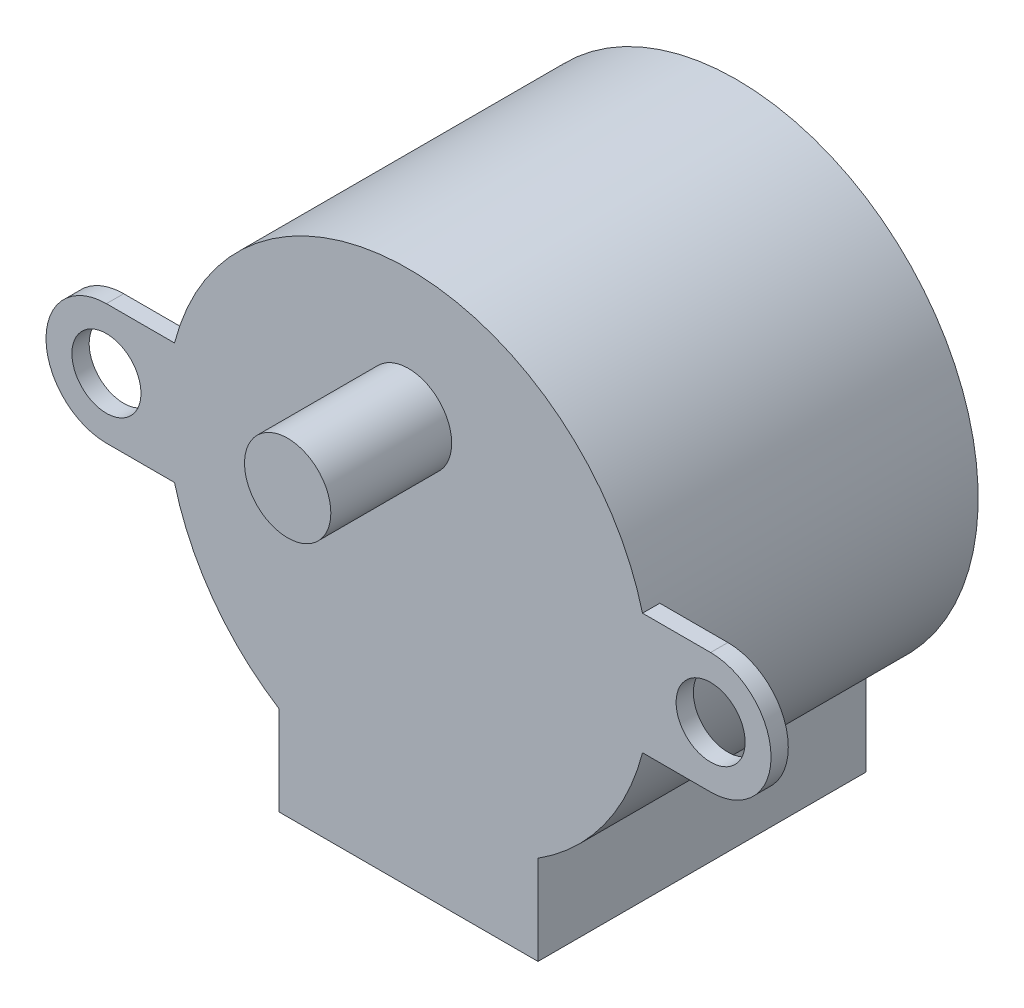
ISO-10303-21;
HEADER;
FILE_DESCRIPTION(('STEP AP214'),'2;1');
FILE_NAME('part.step','',(''),(''),'','','');
FILE_SCHEMA(('AUTOMOTIVE_DESIGN { 1 0 10303 214 1 1 1 1 }'));
ENDSEC;
DATA;
#1=APPLICATION_CONTEXT('core data for automotive mechanical design processes');
#2=APPLICATION_PROTOCOL_DEFINITION('international standard','automotive_design',2000,#1);
#3=PRODUCT_CONTEXT('',#1,'mechanical');
#4=PRODUCT('Part','Part','',(#3));
#5=PRODUCT_RELATED_PRODUCT_CATEGORY('part','',(#4));
#6=PRODUCT_DEFINITION_FORMATION('','',#4);
#7=PRODUCT_DEFINITION_CONTEXT('part definition',#1,'design');
#8=PRODUCT_DEFINITION('design','',#6,#7);
#9=PRODUCT_DEFINITION_SHAPE('','',#8);
#10=(LENGTH_UNIT() NAMED_UNIT(*) SI_UNIT(.MILLI.,.METRE.));
#11=(NAMED_UNIT(*) PLANE_ANGLE_UNIT() SI_UNIT($,.RADIAN.));
#12=(NAMED_UNIT(*) SI_UNIT($,.STERADIAN.) SOLID_ANGLE_UNIT());
#13=UNCERTAINTY_MEASURE_WITH_UNIT(LENGTH_MEASURE(1.E-05),#10,'distance_accuracy_value','');
#14=(GEOMETRIC_REPRESENTATION_CONTEXT(3) GLOBAL_UNCERTAINTY_ASSIGNED_CONTEXT((#13)) GLOBAL_UNIT_ASSIGNED_CONTEXT((#10,
#11,#12)) REPRESENTATION_CONTEXT('',''));
#15=CARTESIAN_POINT('',(0.,0.,0.));
#16=DIRECTION('',(0.,0.,1.));
#17=DIRECTION('',(1.,0.,0.));
#18=AXIS2_PLACEMENT_3D('',#15,#16,#17);
#19=CARTESIAN_POINT('',(17.5,0.,19.));
#20=DIRECTION('',(0.,0.,-1.));
#21=DIRECTION('',(-1.,0.,0.));
#22=AXIS2_PLACEMENT_3D('',#19,#20,#21);
#23=CYLINDRICAL_SURFACE('',#22,3.5);
#24=CARTESIAN_POINT('',(17.5,0.,18.));
#25=DIRECTION('',(0.,0.,-1.));
#26=DIRECTION('',(-1.,0.,0.));
#27=AXIS2_PLACEMENT_3D('',#24,#25,#26);
#28=CIRCLE('',#27,3.5);
#29=CARTESIAN_POINT('',(17.5,3.5,18.));
#30=VERTEX_POINT('',#29);
#31=CARTESIAN_POINT('',(17.5,-3.5,18.));
#32=VERTEX_POINT('',#31);
#33=EDGE_CURVE('E49',#30,#32,#28,.T.);
#34=ORIENTED_EDGE('',*,*,#33,.F.);
#35=DIRECTION('',(0.,0.,-1.));
#36=VECTOR('',#35,1.);
#37=CARTESIAN_POINT('',(17.5,3.5,19.));
#38=LINE('',#37,#36);
#39=CARTESIAN_POINT('',(17.5,3.5,19.));
#40=VERTEX_POINT('',#39);
#41=EDGE_CURVE('E11',#40,#30,#38,.T.);
#42=ORIENTED_EDGE('',*,*,#41,.F.);
#43=CARTESIAN_POINT('',(17.5,0.,19.));
#44=DIRECTION('',(0.,0.,1.));
#45=DIRECTION('',(1.,0.,0.));
#46=AXIS2_PLACEMENT_3D('',#43,#44,#45);
#47=CIRCLE('',#46,3.5);
#48=CARTESIAN_POINT('',(17.5,-3.5,19.));
#49=VERTEX_POINT('',#48);
#50=EDGE_CURVE('E148',#49,#40,#47,.T.);
#51=ORIENTED_EDGE('',*,*,#50,.F.);
#52=DIRECTION('',(0.,0.,-1.));
#53=VECTOR('',#52,1.);
#54=CARTESIAN_POINT('',(17.5,-3.5,19.));
#55=LINE('',#54,#53);
#56=EDGE_CURVE('E135',#49,#32,#55,.T.);
#57=ORIENTED_EDGE('',*,*,#56,.T.);
#58=EDGE_LOOP('',(#34,#42,#51,#57));
#59=FACE_BOUND('',#58,.T.);
#60=ADVANCED_FACE('F33',(#59),#23,.T.);
#61=CARTESIAN_POINT('',(17.5,3.5,19.));
#62=DIRECTION('',(0.,-1.,0.));
#63=DIRECTION('',(0.,0.,-1.));
#64=AXIS2_PLACEMENT_3D('',#61,#62,#63);
#65=PLANE('',#64);
#66=DIRECTION('',(1.,0.,0.));
#67=VECTOR('',#66,1.);
#68=CARTESIAN_POINT('',(13.555441711726,3.5,18.));
#69=LINE('',#68,#67);
#70=CARTESIAN_POINT('',(13.555441711726,3.5,18.));
#71=VERTEX_POINT('',#70);
#72=EDGE_CURVE('E250',#71,#30,#69,.T.);
#73=ORIENTED_EDGE('',*,*,#72,.F.);
#74=DIRECTION('',(0.,0.,-1.));
#75=VECTOR('',#74,1.);
#76=CARTESIAN_POINT('',(13.555441711726,3.5,19.));
#77=LINE('',#76,#75);
#78=CARTESIAN_POINT('',(13.555441711726,3.5,19.));
#79=VERTEX_POINT('',#78);
#80=EDGE_CURVE('E41',#79,#71,#77,.T.);
#81=ORIENTED_EDGE('',*,*,#80,.F.);
#82=DIRECTION('',(-1.,0.,0.));
#83=VECTOR('',#82,1.);
#84=CARTESIAN_POINT('',(17.5,3.5,19.));
#85=LINE('',#84,#83);
#86=EDGE_CURVE('E87',#40,#79,#85,.T.);
#87=ORIENTED_EDGE('',*,*,#86,.F.);
#88=ORIENTED_EDGE('',*,*,#41,.T.);
#89=EDGE_LOOP('',(#73,#81,#87,#88));
#90=FACE_BOUND('',#89,.T.);
#91=ADVANCED_FACE('F249',(#90),#65,.F.);
#92=CARTESIAN_POINT('',(13.555441711726,-3.5,19.));
#93=DIRECTION('',(0.,1.,0.));
#94=DIRECTION('',(0.,0.,1.));
#95=AXIS2_PLACEMENT_3D('',#92,#93,#94);
#96=PLANE('',#95);
#97=DIRECTION('',(-1.,0.,0.));
#98=VECTOR('',#97,1.);
#99=CARTESIAN_POINT('',(13.555441711726,-3.5,18.));
#100=LINE('',#99,#98);
#101=CARTESIAN_POINT('',(13.555441711726,-3.5,18.));
#102=VERTEX_POINT('',#101);
#103=EDGE_CURVE('E254',#32,#102,#100,.T.);
#104=ORIENTED_EDGE('',*,*,#103,.F.);
#105=ORIENTED_EDGE('',*,*,#56,.F.);
#106=DIRECTION('',(1.,0.,0.));
#107=VECTOR('',#106,1.);
#108=CARTESIAN_POINT('',(13.555441711726,-3.5,19.));
#109=LINE('',#108,#107);
#110=CARTESIAN_POINT('',(13.555441711726,-3.50000000000001,19.));
#111=VERTEX_POINT('',#110);
#112=EDGE_CURVE('E58',#111,#49,#109,.T.);
#113=ORIENTED_EDGE('',*,*,#112,.F.);
#114=DIRECTION('',(0.,0.,-1.));
#115=VECTOR('',#114,1.);
#116=CARTESIAN_POINT('',(13.555441711726,-3.50000000000001,19.));
#117=LINE('',#116,#115);
#118=EDGE_CURVE('E129',#111,#102,#117,.T.);
#119=ORIENTED_EDGE('',*,*,#118,.T.);
#120=EDGE_LOOP('',(#104,#105,#113,#119));
#121=FACE_BOUND('',#120,.T.);
#122=ADVANCED_FACE('F285',(#121),#96,.F.);
#123=CARTESIAN_POINT('',(17.5,0.,19.));
#124=DIRECTION('',(0.,0.,-1.));
#125=DIRECTION('',(-1.,0.,0.));
#126=AXIS2_PLACEMENT_3D('',#123,#124,#125);
#127=CYLINDRICAL_SURFACE('',#126,2.);
#128=CARTESIAN_POINT('',(17.5,0.,19.));
#129=DIRECTION('',(0.,0.,1.));
#130=DIRECTION('',(1.,0.,0.));
#131=AXIS2_PLACEMENT_3D('',#128,#129,#130);
#132=CIRCLE('',#131,2.);
#133=CARTESIAN_POINT('',(19.5,0.,19.));
#134=VERTEX_POINT('',#133);
#135=EDGE_CURVE('E142',#134,#134,#132,.T.);
#136=ORIENTED_EDGE('',*,*,#135,.T.);
#137=EDGE_LOOP('',(#136));
#138=FACE_BOUND('',#137,.T.);
#139=CARTESIAN_POINT('',(17.5,0.,18.));
#140=DIRECTION('',(0.,0.,-1.));
#141=DIRECTION('',(-1.,0.,0.));
#142=AXIS2_PLACEMENT_3D('',#139,#140,#141);
#143=CIRCLE('',#142,2.);
#144=CARTESIAN_POINT('',(15.5,0.,18.));
#145=VERTEX_POINT('',#144);
#146=EDGE_CURVE('E36',#145,#145,#143,.T.);
#147=ORIENTED_EDGE('',*,*,#146,.T.);
#148=EDGE_LOOP('',(#147));
#149=FACE_BOUND('',#148,.T.);
#150=ADVANCED_FACE('F265',(#138,#149),#127,.F.);
#151=CARTESIAN_POINT('',(-17.5,3.5,19.));
#152=DIRECTION('',(0.,-1.,0.));
#153=DIRECTION('',(1.,0.,0.));
#154=AXIS2_PLACEMENT_3D('',#151,#152,#153);
#155=PLANE('',#154);
#156=DIRECTION('',(1.,0.,0.));
#157=VECTOR('',#156,1.);
#158=CARTESIAN_POINT('',(-13.555441711726,3.5,18.));
#159=LINE('',#158,#157);
#160=CARTESIAN_POINT('',(-17.5,3.5,18.));
#161=VERTEX_POINT('',#160);
#162=CARTESIAN_POINT('',(-13.555441711726,3.5,18.));
#163=VERTEX_POINT('',#162);
#164=EDGE_CURVE('E175',#161,#163,#159,.T.);
#165=ORIENTED_EDGE('',*,*,#164,.F.);
#166=DIRECTION('',(0.,0.,-1.));
#167=VECTOR('',#166,1.);
#168=CARTESIAN_POINT('',(-17.5,3.5,19.));
#169=LINE('',#168,#167);
#170=CARTESIAN_POINT('',(-17.5,3.5,19.));
#171=VERTEX_POINT('',#170);
#172=EDGE_CURVE('E165',#171,#161,#169,.T.);
#173=ORIENTED_EDGE('',*,*,#172,.F.);
#174=DIRECTION('',(-1.,0.,0.));
#175=VECTOR('',#174,1.);
#176=CARTESIAN_POINT('',(-17.5,3.5,19.));
#177=LINE('',#176,#175);
#178=CARTESIAN_POINT('',(-13.555441711726,3.5,19.));
#179=VERTEX_POINT('',#178);
#180=EDGE_CURVE('E202',#179,#171,#177,.T.);
#181=ORIENTED_EDGE('',*,*,#180,.F.);
#182=DIRECTION('',(0.,0.,-1.));
#183=VECTOR('',#182,1.);
#184=CARTESIAN_POINT('',(-13.555441711726,3.5,19.));
#185=LINE('',#184,#183);
#186=EDGE_CURVE('E168',#179,#163,#185,.T.);
#187=ORIENTED_EDGE('',*,*,#186,.T.);
#188=EDGE_LOOP('',(#165,#173,#181,#187));
#189=FACE_BOUND('',#188,.T.);
#190=ADVANCED_FACE('F242',(#189),#155,.F.);
#191=CARTESIAN_POINT('',(-17.5,0.,19.));
#192=DIRECTION('',(0.,0.,-1.));
#193=DIRECTION('',(-1.,0.,0.));
#194=AXIS2_PLACEMENT_3D('',#191,#192,#193);
#195=CYLINDRICAL_SURFACE('',#194,3.5);
#196=CARTESIAN_POINT('',(-17.5,0.,18.));
#197=DIRECTION('',(0.,0.,-1.));
#198=DIRECTION('',(-1.,0.,0.));
#199=AXIS2_PLACEMENT_3D('',#196,#197,#198);
#200=CIRCLE('',#199,3.5);
#201=CARTESIAN_POINT('',(-17.5,-3.5,18.));
#202=VERTEX_POINT('',#201);
#203=EDGE_CURVE('E174',#202,#161,#200,.T.);
#204=ORIENTED_EDGE('',*,*,#203,.F.);
#205=DIRECTION('',(0.,0.,-1.));
#206=VECTOR('',#205,1.);
#207=CARTESIAN_POINT('',(-17.5,-3.5,19.));
#208=LINE('',#207,#206);
#209=CARTESIAN_POINT('',(-17.5,-3.5,19.));
#210=VERTEX_POINT('',#209);
#211=EDGE_CURVE('E162',#210,#202,#208,.T.);
#212=ORIENTED_EDGE('',*,*,#211,.F.);
#213=CARTESIAN_POINT('',(-17.5,0.,19.));
#214=DIRECTION('',(0.,0.,1.));
#215=DIRECTION('',(-1.,0.,0.));
#216=AXIS2_PLACEMENT_3D('',#213,#214,#215);
#217=CIRCLE('',#216,3.5);
#218=EDGE_CURVE('E204',#171,#210,#217,.T.);
#219=ORIENTED_EDGE('',*,*,#218,.F.);
#220=ORIENTED_EDGE('',*,*,#172,.T.);
#221=EDGE_LOOP('',(#204,#212,#219,#220));
#222=FACE_BOUND('',#221,.T.);
#223=ADVANCED_FACE('F237',(#222),#195,.T.);
#224=CARTESIAN_POINT('',(-13.555441711726,-3.5,19.));
#225=DIRECTION('',(0.,1.,0.));
#226=DIRECTION('',(-1.,0.,0.));
#227=AXIS2_PLACEMENT_3D('',#224,#225,#226);
#228=PLANE('',#227);
#229=DIRECTION('',(-1.,0.,0.));
#230=VECTOR('',#229,1.);
#231=CARTESIAN_POINT('',(-13.555441711726,-3.5,18.));
#232=LINE('',#231,#230);
#233=CARTESIAN_POINT('',(-13.555441711726,-3.5,18.));
#234=VERTEX_POINT('',#233);
#235=EDGE_CURVE('E182',#234,#202,#232,.T.);
#236=ORIENTED_EDGE('',*,*,#235,.F.);
#237=DIRECTION('',(0.,0.,-1.));
#238=VECTOR('',#237,1.);
#239=CARTESIAN_POINT('',(-13.555441711726,-3.5,19.));
#240=LINE('',#239,#238);
#241=CARTESIAN_POINT('',(-13.555441711726,-3.5,19.));
#242=VERTEX_POINT('',#241);
#243=EDGE_CURVE('E159',#242,#234,#240,.T.);
#244=ORIENTED_EDGE('',*,*,#243,.F.);
#245=DIRECTION('',(1.,0.,0.));
#246=VECTOR('',#245,1.);
#247=CARTESIAN_POINT('',(-13.555441711726,-3.5,19.));
#248=LINE('',#247,#246);
#249=EDGE_CURVE('E206',#210,#242,#248,.T.);
#250=ORIENTED_EDGE('',*,*,#249,.F.);
#251=ORIENTED_EDGE('',*,*,#211,.T.);
#252=EDGE_LOOP('',(#236,#244,#250,#251));
#253=FACE_BOUND('',#252,.T.);
#254=ADVANCED_FACE('F231',(#253),#228,.F.);
#255=CARTESIAN_POINT('',(-17.5,0.,19.));
#256=DIRECTION('',(0.,0.,-1.));
#257=DIRECTION('',(-1.,0.,0.));
#258=AXIS2_PLACEMENT_3D('',#255,#256,#257);
#259=CYLINDRICAL_SURFACE('',#258,2.);
#260=CARTESIAN_POINT('',(-17.5,0.,19.));
#261=DIRECTION('',(0.,0.,1.));
#262=DIRECTION('',(-1.,0.,0.));
#263=AXIS2_PLACEMENT_3D('',#260,#261,#262);
#264=CIRCLE('',#263,2.);
#265=CARTESIAN_POINT('',(-19.5,0.,19.));
#266=VERTEX_POINT('',#265);
#267=EDGE_CURVE('E179',#266,#266,#264,.T.);
#268=ORIENTED_EDGE('',*,*,#267,.T.);
#269=EDGE_LOOP('',(#268));
#270=FACE_BOUND('',#269,.T.);
#271=CARTESIAN_POINT('',(-17.5,0.,18.));
#272=DIRECTION('',(0.,0.,-1.));
#273=DIRECTION('',(-1.,0.,0.));
#274=AXIS2_PLACEMENT_3D('',#271,#272,#273);
#275=CIRCLE('',#274,2.);
#276=CARTESIAN_POINT('',(-19.5,0.,18.));
#277=VERTEX_POINT('',#276);
#278=EDGE_CURVE('E172',#277,#277,#275,.T.);
#279=ORIENTED_EDGE('',*,*,#278,.T.);
#280=EDGE_LOOP('',(#279));
#281=FACE_BOUND('',#280,.T.);
#282=ADVANCED_FACE('F309',(#270,#281),#259,.F.);
#283=CARTESIAN_POINT('',(17.5,0.,19.));
#284=DIRECTION('',(0.,0.,1.));
#285=DIRECTION('',(1.,0.,0.));
#286=AXIS2_PLACEMENT_3D('',#283,#284,#285);
#287=PLANE('',#286);
#288=CARTESIAN_POINT('',(0.,6.5,19.));
#289=DIRECTION('',(0.,0.,1.));
#290=DIRECTION('',(1.,0.,0.));
#291=AXIS2_PLACEMENT_3D('',#288,#289,#290);
#292=CIRCLE('',#291,2.5);
#293=CARTESIAN_POINT('',(2.5,6.5,19.));
#294=VERTEX_POINT('',#293);
#295=EDGE_CURVE('E388',#294,#294,#292,.T.);
#296=ORIENTED_EDGE('',*,*,#295,.F.);
#297=EDGE_LOOP('',(#296));
#298=FACE_BOUND('',#297,.T.);
#299=ORIENTED_EDGE('',*,*,#135,.F.);
#300=EDGE_LOOP('',(#299));
#301=FACE_BOUND('',#300,.T.);
#302=ORIENTED_EDGE('',*,*,#50,.T.);
#303=ORIENTED_EDGE('',*,*,#86,.T.);
#304=CARTESIAN_POINT('',(0.,0.,19.));
#305=DIRECTION('',(0.,0.,1.));
#306=DIRECTION('',(1.,0.,0.));
#307=AXIS2_PLACEMENT_3D('',#304,#305,#306);
#308=CIRCLE('',#307,14.);
#309=EDGE_CURVE('E200',#79,#179,#308,.T.);
#310=ORIENTED_EDGE('',*,*,#309,.T.);
#311=ORIENTED_EDGE('',*,*,#180,.T.);
#312=ORIENTED_EDGE('',*,*,#218,.T.);
#313=ORIENTED_EDGE('',*,*,#249,.T.);
#314=CARTESIAN_POINT('',(0.,0.,19.));
#315=DIRECTION('',(0.,0.,1.));
#316=DIRECTION('',(1.,0.,0.));
#317=AXIS2_PLACEMENT_3D('',#314,#315,#316);
#318=CIRCLE('',#317,14.);
#319=CARTESIAN_POINT('',(-7.5,-11.8215904175369,19.));
#320=VERTEX_POINT('',#319);
#321=EDGE_CURVE('E208',#242,#320,#318,.T.);
#322=ORIENTED_EDGE('',*,*,#321,.T.);
#323=DIRECTION('',(0.,-1.,0.));
#324=VECTOR('',#323,1.);
#325=CARTESIAN_POINT('',(-7.5,-14.,19.));
#326=LINE('',#325,#324);
#327=CARTESIAN_POINT('',(-7.5,-17.,19.));
#328=VERTEX_POINT('',#327);
#329=EDGE_CURVE('E210',#320,#328,#326,.T.);
#330=ORIENTED_EDGE('',*,*,#329,.T.);
#331=DIRECTION('',(1.,0.,0.));
#332=VECTOR('',#331,1.);
#333=CARTESIAN_POINT('',(7.5,-17.,19.));
#334=LINE('',#333,#332);
#335=CARTESIAN_POINT('',(7.5,-17.,19.));
#336=VERTEX_POINT('',#335);
#337=EDGE_CURVE('E121',#328,#336,#334,.T.);
#338=ORIENTED_EDGE('',*,*,#337,.T.);
#339=DIRECTION('',(0.,1.,0.));
#340=VECTOR('',#339,1.);
#341=CARTESIAN_POINT('',(7.5,-14.,19.));
#342=LINE('',#341,#340);
#343=CARTESIAN_POINT('',(7.5,-11.8215904175369,19.));
#344=VERTEX_POINT('',#343);
#345=EDGE_CURVE('E114',#336,#344,#342,.T.);
#346=ORIENTED_EDGE('',*,*,#345,.T.);
#347=CARTESIAN_POINT('',(0.,0.,19.));
#348=DIRECTION('',(0.,0.,1.));
#349=DIRECTION('',(1.,0.,0.));
#350=AXIS2_PLACEMENT_3D('',#347,#348,#349);
#351=CIRCLE('',#350,14.);
#352=EDGE_CURVE('E118',#344,#111,#351,.T.);
#353=ORIENTED_EDGE('',*,*,#352,.T.);
#354=ORIENTED_EDGE('',*,*,#112,.T.);
#355=EDGE_LOOP('',(#302,#303,#310,#311,#312,#313,#322,#330,#338,#346,#353,#354));
#356=FACE_BOUND('',#355,.T.);
#357=ORIENTED_EDGE('',*,*,#267,.F.);
#358=EDGE_LOOP('',(#357));
#359=FACE_BOUND('',#358,.T.);
#360=ADVANCED_FACE('F115',(#298,#301,#356,#359),#287,.T.);
#361=CARTESIAN_POINT('',(17.5,0.,0.));
#362=DIRECTION('',(0.,0.,1.));
#363=DIRECTION('',(1.,0.,0.));
#364=AXIS2_PLACEMENT_3D('',#361,#362,#363);
#365=PLANE('',#364);
#366=DIRECTION('',(0.,-1.,0.));
#367=VECTOR('',#366,1.);
#368=CARTESIAN_POINT('',(-7.5,-14.,0.));
#369=LINE('',#368,#367);
#370=CARTESIAN_POINT('',(-7.5,-11.8215904175369,0.));
#371=VERTEX_POINT('',#370);
#372=CARTESIAN_POINT('',(-7.5,-17.,0.));
#373=VERTEX_POINT('',#372);
#374=EDGE_CURVE('E139',#371,#373,#369,.T.);
#375=ORIENTED_EDGE('',*,*,#374,.F.);
#376=CARTESIAN_POINT('',(0.,0.,0.));
#377=DIRECTION('',(0.,0.,1.));
#378=DIRECTION('',(1.,0.,0.));
#379=AXIS2_PLACEMENT_3D('',#376,#377,#378);
#380=CIRCLE('',#379,14.);
#381=CARTESIAN_POINT('',(7.5,-11.8215904175369,0.));
#382=VERTEX_POINT('',#381);
#383=EDGE_CURVE('E146',#382,#371,#380,.T.);
#384=ORIENTED_EDGE('',*,*,#383,.F.);
#385=DIRECTION('',(0.,1.,0.));
#386=VECTOR('',#385,1.);
#387=CARTESIAN_POINT('',(7.5,-14.,0.));
#388=LINE('',#387,#386);
#389=CARTESIAN_POINT('',(7.5,-17.,0.));
#390=VERTEX_POINT('',#389);
#391=EDGE_CURVE('E79',#390,#382,#388,.T.);
#392=ORIENTED_EDGE('',*,*,#391,.F.);
#393=DIRECTION('',(1.,0.,0.));
#394=VECTOR('',#393,1.);
#395=CARTESIAN_POINT('',(7.5,-17.,0.));
#396=LINE('',#395,#394);
#397=EDGE_CURVE('E141',#373,#390,#396,.T.);
#398=ORIENTED_EDGE('',*,*,#397,.F.);
#399=EDGE_LOOP('',(#375,#384,#392,#398));
#400=FACE_BOUND('',#399,.T.);
#401=ADVANCED_FACE('F222',(#400),#365,.F.);
#402=CARTESIAN_POINT('',(-7.5,-14.,19.));
#403=DIRECTION('',(1.,0.,0.));
#404=DIRECTION('',(0.,0.,-1.));
#405=AXIS2_PLACEMENT_3D('',#402,#403,#404);
#406=PLANE('',#405);
#407=ORIENTED_EDGE('',*,*,#374,.T.);
#408=DIRECTION('',(0.,0.,-1.));
#409=VECTOR('',#408,1.);
#410=CARTESIAN_POINT('',(-7.5,-17.,19.));
#411=LINE('',#410,#409);
#412=EDGE_CURVE('E153',#328,#373,#411,.T.);
#413=ORIENTED_EDGE('',*,*,#412,.F.);
#414=ORIENTED_EDGE('',*,*,#329,.F.);
#415=DIRECTION('',(0.,0.,-1.));
#416=VECTOR('',#415,1.);
#417=CARTESIAN_POINT('',(-7.5,-11.8215904175369,19.));
#418=LINE('',#417,#416);
#419=EDGE_CURVE('E156',#320,#371,#418,.T.);
#420=ORIENTED_EDGE('',*,*,#419,.T.);
#421=EDGE_LOOP('',(#407,#413,#414,#420));
#422=FACE_BOUND('',#421,.T.);
#423=ADVANCED_FACE('F216',(#422),#406,.F.);
#424=CARTESIAN_POINT('',(7.5,-17.,19.));
#425=DIRECTION('',(0.,1.,0.));
#426=DIRECTION('',(0.,0.,1.));
#427=AXIS2_PLACEMENT_3D('',#424,#425,#426);
#428=PLANE('',#427);
#429=ORIENTED_EDGE('',*,*,#397,.T.);
#430=DIRECTION('',(0.,0.,-1.));
#431=VECTOR('',#430,1.);
#432=CARTESIAN_POINT('',(7.5,-17.,19.));
#433=LINE('',#432,#431);
#434=EDGE_CURVE('E128',#336,#390,#433,.T.);
#435=ORIENTED_EDGE('',*,*,#434,.F.);
#436=ORIENTED_EDGE('',*,*,#337,.F.);
#437=ORIENTED_EDGE('',*,*,#412,.T.);
#438=EDGE_LOOP('',(#429,#435,#436,#437));
#439=FACE_BOUND('',#438,.T.);
#440=ADVANCED_FACE('F220',(#439),#428,.F.);
#441=CARTESIAN_POINT('',(7.5,-14.,19.));
#442=DIRECTION('',(-1.,0.,0.));
#443=DIRECTION('',(0.,0.,1.));
#444=AXIS2_PLACEMENT_3D('',#441,#442,#443);
#445=PLANE('',#444);
#446=ORIENTED_EDGE('',*,*,#391,.T.);
#447=DIRECTION('',(0.,0.,-1.));
#448=VECTOR('',#447,1.);
#449=CARTESIAN_POINT('',(7.5,-11.8215904175369,19.));
#450=LINE('',#449,#448);
#451=EDGE_CURVE('E124',#344,#382,#450,.T.);
#452=ORIENTED_EDGE('',*,*,#451,.F.);
#453=ORIENTED_EDGE('',*,*,#345,.F.);
#454=ORIENTED_EDGE('',*,*,#434,.T.);
#455=EDGE_LOOP('',(#446,#452,#453,#454));
#456=FACE_BOUND('',#455,.T.);
#457=ADVANCED_FACE('F125',(#456),#445,.F.);
#458=CARTESIAN_POINT('',(0.,0.,19.));
#459=DIRECTION('',(0.,0.,-1.));
#460=DIRECTION('',(-1.,0.,0.));
#461=AXIS2_PLACEMENT_3D('',#458,#459,#460);
#462=CYLINDRICAL_SURFACE('',#461,14.);
#463=ORIENTED_EDGE('',*,*,#383,.T.);
#464=ORIENTED_EDGE('',*,*,#419,.F.);
#465=ORIENTED_EDGE('',*,*,#321,.F.);
#466=ORIENTED_EDGE('',*,*,#243,.T.);
#467=CARTESIAN_POINT('',(0.,0.,18.));
#468=DIRECTION('',(0.,0.,1.));
#469=DIRECTION('',(-1.,0.,0.));
#470=AXIS2_PLACEMENT_3D('',#467,#468,#469);
#471=CIRCLE('',#470,14.);
#472=EDGE_CURVE('E190',#163,#234,#471,.T.);
#473=ORIENTED_EDGE('',*,*,#472,.F.);
#474=ORIENTED_EDGE('',*,*,#186,.F.);
#475=ORIENTED_EDGE('',*,*,#309,.F.);
#476=ORIENTED_EDGE('',*,*,#80,.T.);
#477=CARTESIAN_POINT('',(0.,0.,18.));
#478=DIRECTION('',(0.,0.,1.));
#479=DIRECTION('',(-1.,0.,0.));
#480=AXIS2_PLACEMENT_3D('',#477,#478,#479);
#481=CIRCLE('',#480,14.);
#482=EDGE_CURVE('E255',#102,#71,#481,.T.);
#483=ORIENTED_EDGE('',*,*,#482,.F.);
#484=ORIENTED_EDGE('',*,*,#118,.F.);
#485=ORIENTED_EDGE('',*,*,#352,.F.);
#486=ORIENTED_EDGE('',*,*,#451,.T.);
#487=EDGE_LOOP('',(#463,#464,#465,#466,#473,#474,#475,#476,#483,#484,#485,#486));
#488=FACE_BOUND('',#487,.T.);
#489=ADVANCED_FACE('F131',(#488),#462,.T.);
#490=CARTESIAN_POINT('',(0.,0.,18.));
#491=DIRECTION('',(0.,0.,-1.));
#492=DIRECTION('',(-1.,0.,0.));
#493=AXIS2_PLACEMENT_3D('',#490,#491,#492);
#494=PLANE('',#493);
#495=ORIENTED_EDGE('',*,*,#278,.F.);
#496=EDGE_LOOP('',(#495));
#497=FACE_BOUND('',#496,.T.);
#498=ORIENTED_EDGE('',*,*,#203,.T.);
#499=ORIENTED_EDGE('',*,*,#164,.T.);
#500=ORIENTED_EDGE('',*,*,#472,.T.);
#501=ORIENTED_EDGE('',*,*,#235,.T.);
#502=EDGE_LOOP('',(#498,#499,#500,#501));
#503=FACE_BOUND('',#502,.T.);
#504=ADVANCED_FACE('F234',(#497,#503),#494,.T.);
#505=CARTESIAN_POINT('',(0.,0.,18.));
#506=DIRECTION('',(0.,0.,-1.));
#507=DIRECTION('',(-1.,0.,0.));
#508=AXIS2_PLACEMENT_3D('',#505,#506,#507);
#509=PLANE('',#508);
#510=ORIENTED_EDGE('',*,*,#146,.F.);
#511=EDGE_LOOP('',(#510));
#512=FACE_BOUND('',#511,.T.);
#513=ORIENTED_EDGE('',*,*,#33,.T.);
#514=ORIENTED_EDGE('',*,*,#103,.T.);
#515=ORIENTED_EDGE('',*,*,#482,.T.);
#516=ORIENTED_EDGE('',*,*,#72,.T.);
#517=EDGE_LOOP('',(#513,#514,#515,#516));
#518=FACE_BOUND('',#517,.T.);
#519=ADVANCED_FACE('F267',(#512,#518),#509,.T.);
#520=CARTESIAN_POINT('',(0.,6.5,26.));
#521=DIRECTION('',(0.,0.,-1.));
#522=DIRECTION('',(-1.,0.,0.));
#523=AXIS2_PLACEMENT_3D('',#520,#521,#522);
#524=CYLINDRICAL_SURFACE('',#523,2.5);
#525=CARTESIAN_POINT('',(0.,6.5,26.));
#526=DIRECTION('',(0.,0.,1.));
#527=DIRECTION('',(1.,0.,0.));
#528=AXIS2_PLACEMENT_3D('',#525,#526,#527);
#529=CIRCLE('',#528,2.5);
#530=CARTESIAN_POINT('',(2.5,6.5,26.));
#531=VERTEX_POINT('',#530);
#532=EDGE_CURVE('E258',#531,#531,#529,.T.);
#533=ORIENTED_EDGE('',*,*,#532,.F.);
#534=EDGE_LOOP('',(#533));
#535=FACE_BOUND('',#534,.T.);
#536=ORIENTED_EDGE('',*,*,#295,.T.);
#537=EDGE_LOOP('',(#536));
#538=FACE_BOUND('',#537,.T.);
#539=ADVANCED_FACE('F269',(#535,#538),#524,.T.);
#540=CARTESIAN_POINT('',(0.,6.5,26.));
#541=DIRECTION('',(0.,0.,1.));
#542=DIRECTION('',(1.,0.,0.));
#543=AXIS2_PLACEMENT_3D('',#540,#541,#542);
#544=PLANE('',#543);
#545=ORIENTED_EDGE('',*,*,#532,.T.);
#546=EDGE_LOOP('',(#545));
#547=FACE_BOUND('',#546,.T.);
#548=ADVANCED_FACE('F275',(#547),#544,.T.);
#549=CLOSED_SHELL('',(#60,#91,#122,#150,#190,#223,#254,#282,#360,#401,#423,#440,#457,#489,#504,
#519,#539,#548));
#550=MANIFOLD_SOLID_BREP('B2',#549);
#551=ADVANCED_BREP_SHAPE_REPRESENTATION('',(#18,#550),#14);
#552=SHAPE_DEFINITION_REPRESENTATION(#9,#551);
ENDSEC;
END-ISO-10303-21;
